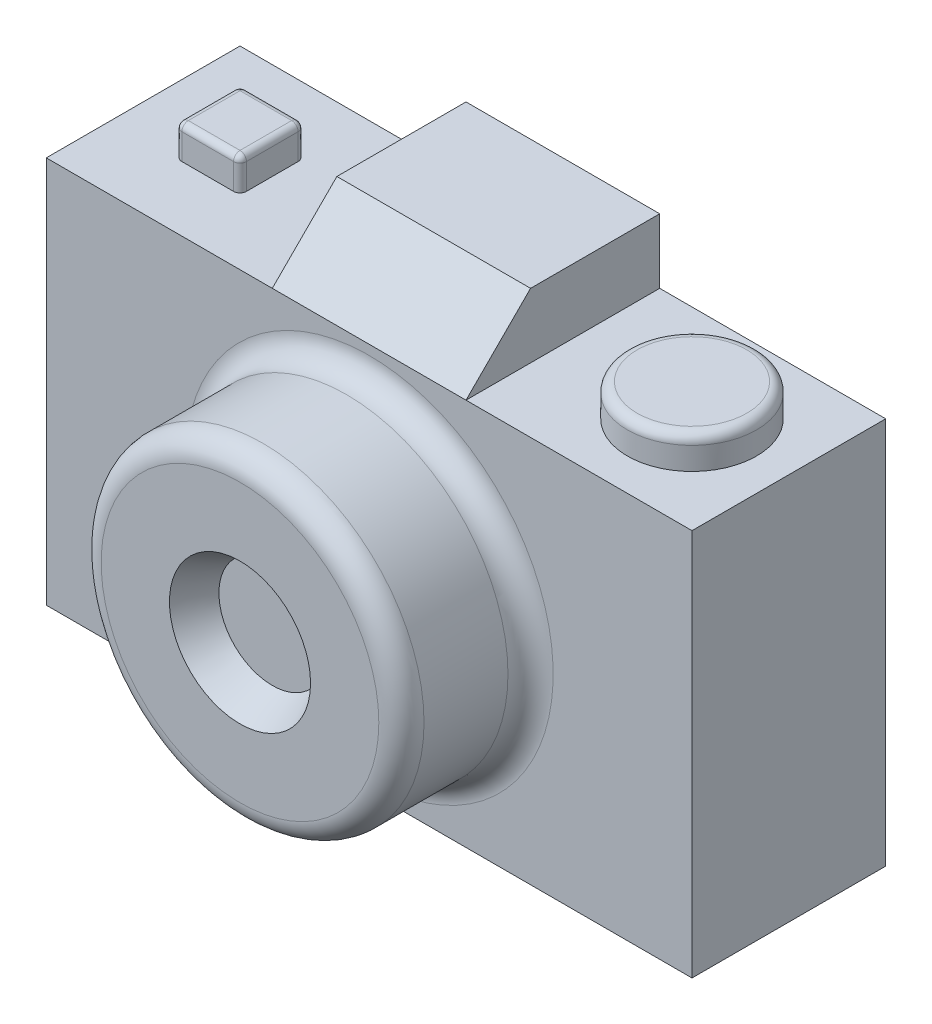
ISO-10303-21;
HEADER;
FILE_DESCRIPTION(('STEP AP214'),'2;1');
FILE_NAME('part.step','',(''),(''),'','','');
FILE_SCHEMA(('AUTOMOTIVE_DESIGN { 1 0 10303 214 1 1 1 1 }'));
ENDSEC;
DATA;
#1=APPLICATION_CONTEXT('core data for automotive mechanical design processes');
#2=APPLICATION_PROTOCOL_DEFINITION('international standard','automotive_design',2000,#1);
#3=PRODUCT_CONTEXT('',#1,'mechanical');
#4=PRODUCT('Part','Part','',(#3));
#5=PRODUCT_RELATED_PRODUCT_CATEGORY('part','',(#4));
#6=PRODUCT_DEFINITION_FORMATION('','',#4);
#7=PRODUCT_DEFINITION_CONTEXT('part definition',#1,'design');
#8=PRODUCT_DEFINITION('design','',#6,#7);
#9=PRODUCT_DEFINITION_SHAPE('','',#8);
#10=(LENGTH_UNIT() NAMED_UNIT(*) SI_UNIT(.MILLI.,.METRE.));
#11=(NAMED_UNIT(*) PLANE_ANGLE_UNIT() SI_UNIT($,.RADIAN.));
#12=(NAMED_UNIT(*) SI_UNIT($,.STERADIAN.) SOLID_ANGLE_UNIT());
#13=UNCERTAINTY_MEASURE_WITH_UNIT(LENGTH_MEASURE(1.E-05),#10,'distance_accuracy_value','');
#14=(GEOMETRIC_REPRESENTATION_CONTEXT(3) GLOBAL_UNCERTAINTY_ASSIGNED_CONTEXT((#13)) GLOBAL_UNIT_ASSIGNED_CONTEXT((#10,
#11,#12)) REPRESENTATION_CONTEXT('',''));
#15=CARTESIAN_POINT('',(0.,0.,0.));
#16=DIRECTION('',(0.,0.,1.));
#17=DIRECTION('',(1.,0.,0.));
#18=AXIS2_PLACEMENT_3D('',#15,#16,#17);
#19=CARTESIAN_POINT('',(0.,60.,0.));
#20=DIRECTION('',(0.,-1.,0.));
#21=DIRECTION('',(0.,0.,-1.));
#22=AXIS2_PLACEMENT_3D('',#19,#20,#21);
#23=PLANE('',#22);
#24=DIRECTION('',(0.,0.,-1.));
#25=VECTOR('',#24,1.);
#26=CARTESIAN_POINT('',(20.,60.,-20.));
#27=LINE('',#26,#25);
#28=CARTESIAN_POINT('',(20.,60.,-11.));
#29=VERTEX_POINT('',#28);
#30=CARTESIAN_POINT('',(20.,60.,-19.));
#31=VERTEX_POINT('',#30);
#32=EDGE_CURVE('E178',#29,#31,#27,.T.);
#33=ORIENTED_EDGE('',*,*,#32,.F.);
#34=CARTESIAN_POINT('',(19.,60.,-11.));
#35=DIRECTION('',(0.,-1.,0.));
#36=DIRECTION('',(0.,0.,-1.));
#37=AXIS2_PLACEMENT_3D('',#34,#35,#36);
#38=CIRCLE('',#37,1.);
#39=CARTESIAN_POINT('',(19.,60.,-10.));
#40=VERTEX_POINT('',#39);
#41=EDGE_CURVE('E282',#29,#40,#38,.T.);
#42=ORIENTED_EDGE('',*,*,#41,.T.);
#43=DIRECTION('',(1.,0.,0.));
#44=VECTOR('',#43,1.);
#45=CARTESIAN_POINT('',(10.,60.,-10.));
#46=LINE('',#45,#44);
#47=CARTESIAN_POINT('',(11.,60.,-10.));
#48=VERTEX_POINT('',#47);
#49=EDGE_CURVE('E200',#48,#40,#46,.T.);
#50=ORIENTED_EDGE('',*,*,#49,.F.);
#51=CARTESIAN_POINT('',(11.,60.,-11.));
#52=DIRECTION('',(0.,-1.,0.));
#53=DIRECTION('',(0.,0.,-1.));
#54=AXIS2_PLACEMENT_3D('',#51,#52,#53);
#55=CIRCLE('',#54,1.);
#56=CARTESIAN_POINT('',(10.,60.,-11.));
#57=VERTEX_POINT('',#56);
#58=EDGE_CURVE('E284',#48,#57,#55,.T.);
#59=ORIENTED_EDGE('',*,*,#58,.T.);
#60=DIRECTION('',(0.,0.,1.));
#61=VECTOR('',#60,1.);
#62=CARTESIAN_POINT('',(10.,60.,-20.));
#63=LINE('',#62,#61);
#64=CARTESIAN_POINT('',(10.,60.,-19.));
#65=VERTEX_POINT('',#64);
#66=EDGE_CURVE('E197',#65,#57,#63,.T.);
#67=ORIENTED_EDGE('',*,*,#66,.F.);
#68=CARTESIAN_POINT('',(11.,60.,-19.));
#69=DIRECTION('',(0.,-1.,0.));
#70=DIRECTION('',(0.,0.,-1.));
#71=AXIS2_PLACEMENT_3D('',#68,#69,#70);
#72=CIRCLE('',#71,1.);
#73=CARTESIAN_POINT('',(11.,60.,-20.));
#74=VERTEX_POINT('',#73);
#75=EDGE_CURVE('E278',#65,#74,#72,.T.);
#76=ORIENTED_EDGE('',*,*,#75,.T.);
#77=DIRECTION('',(-1.,0.,0.));
#78=VECTOR('',#77,1.);
#79=CARTESIAN_POINT('',(10.,60.,-20.));
#80=LINE('',#79,#78);
#81=CARTESIAN_POINT('',(19.,60.,-20.));
#82=VERTEX_POINT('',#81);
#83=EDGE_CURVE('E194',#82,#74,#80,.T.);
#84=ORIENTED_EDGE('',*,*,#83,.F.);
#85=CARTESIAN_POINT('',(19.,60.,-19.));
#86=DIRECTION('',(0.,-1.,0.));
#87=DIRECTION('',(0.,0.,-1.));
#88=AXIS2_PLACEMENT_3D('',#85,#86,#87);
#89=CIRCLE('',#88,1.);
#90=EDGE_CURVE('E280',#82,#31,#89,.T.);
#91=ORIENTED_EDGE('',*,*,#90,.T.);
#92=EDGE_LOOP('',(#33,#42,#50,#59,#67,#76,#84,#91));
#93=FACE_BOUND('',#92,.T.);
#94=DIRECTION('',(0.,0.,1.));
#95=VECTOR('',#94,1.);
#96=CARTESIAN_POINT('',(35.,60.,-30.));
#97=LINE('',#96,#95);
#98=CARTESIAN_POINT('',(35.,60.,-30.));
#99=VERTEX_POINT('',#98);
#100=CARTESIAN_POINT('',(35.,60.,0.));
#101=VERTEX_POINT('',#100);
#102=EDGE_CURVE('E188',#99,#101,#97,.T.);
#103=ORIENTED_EDGE('',*,*,#102,.F.);
#104=DIRECTION('',(-1.,0.,0.));
#105=VECTOR('',#104,1.);
#106=CARTESIAN_POINT('',(0.,60.,-30.));
#107=LINE('',#106,#105);
#108=CARTESIAN_POINT('',(0.,60.,-30.));
#109=VERTEX_POINT('',#108);
#110=EDGE_CURVE('E214',#99,#109,#107,.T.);
#111=ORIENTED_EDGE('',*,*,#110,.T.);
#112=DIRECTION('',(0.,0.,1.));
#113=VECTOR('',#112,1.);
#114=CARTESIAN_POINT('',(0.,60.,0.));
#115=LINE('',#114,#113);
#116=CARTESIAN_POINT('',(0.,60.,0.));
#117=VERTEX_POINT('',#116);
#118=EDGE_CURVE('E204',#109,#117,#115,.T.);
#119=ORIENTED_EDGE('',*,*,#118,.T.);
#120=DIRECTION('',(1.,0.,0.));
#121=VECTOR('',#120,1.);
#122=CARTESIAN_POINT('',(0.,60.,0.));
#123=LINE('',#122,#121);
#124=EDGE_CURVE('E209',#117,#101,#123,.T.);
#125=ORIENTED_EDGE('',*,*,#124,.T.);
#126=EDGE_LOOP('',(#103,#111,#119,#125));
#127=FACE_BOUND('',#126,.T.);
#128=ADVANCED_FACE('F33',(#93,#127),#23,.F.);
#129=CARTESIAN_POINT('',(85.,60.,-15.));
#130=DIRECTION('',(0.,-1.,0.));
#131=DIRECTION('',(0.,0.,-1.));
#132=AXIS2_PLACEMENT_3D('',#129,#130,#131);
#133=CIRCLE('',#132,9.99999999999999);
#134=CARTESIAN_POINT('',(85.,60.,-25.));
#135=VERTEX_POINT('',#134);
#136=EDGE_CURVE('E236',#135,#135,#133,.F.);
#137=ORIENTED_EDGE('',*,*,#136,.F.);
#138=EDGE_LOOP('',(#137));
#139=FACE_BOUND('',#138,.T.);
#140=DIRECTION('',(0.,0.,-1.));
#141=VECTOR('',#140,1.);
#142=CARTESIAN_POINT('',(65.,60.,-30.));
#143=LINE('',#142,#141);
#144=CARTESIAN_POINT('',(65.,60.,0.));
#145=VERTEX_POINT('',#144);
#146=CARTESIAN_POINT('',(65.,60.,-30.));
#147=VERTEX_POINT('',#146);
#148=EDGE_CURVE('E175',#145,#147,#143,.T.);
#149=ORIENTED_EDGE('',*,*,#148,.F.);
#150=CARTESIAN_POINT('',(100.,60.,0.));
#151=VERTEX_POINT('',#150);
#152=EDGE_CURVE('E207',#145,#151,#123,.T.);
#153=ORIENTED_EDGE('',*,*,#152,.T.);
#154=DIRECTION('',(0.,0.,-1.));
#155=VECTOR('',#154,1.);
#156=CARTESIAN_POINT('',(100.,60.,0.));
#157=LINE('',#156,#155);
#158=CARTESIAN_POINT('',(100.,60.,-30.));
#159=VERTEX_POINT('',#158);
#160=EDGE_CURVE('E212',#151,#159,#157,.T.);
#161=ORIENTED_EDGE('',*,*,#160,.T.);
#162=EDGE_CURVE('E215',#159,#147,#107,.T.);
#163=ORIENTED_EDGE('',*,*,#162,.T.);
#164=EDGE_LOOP('',(#149,#153,#161,#163));
#165=FACE_BOUND('',#164,.T.);
#166=ADVANCED_FACE('F368',(#139,#165),#23,.F.);
#167=CARTESIAN_POINT('',(0.,60.,0.));
#168=DIRECTION('',(1.,0.,0.));
#169=DIRECTION('',(0.,0.,-1.));
#170=AXIS2_PLACEMENT_3D('',#167,#168,#169);
#171=PLANE('',#170);
#172=DIRECTION('',(0.,0.,1.));
#173=VECTOR('',#172,1.);
#174=CARTESIAN_POINT('',(0.,0.,0.));
#175=LINE('',#174,#173);
#176=CARTESIAN_POINT('',(0.,0.,-30.));
#177=VERTEX_POINT('',#176);
#178=CARTESIAN_POINT('',(0.,0.,0.));
#179=VERTEX_POINT('',#178);
#180=EDGE_CURVE('E203',#177,#179,#175,.T.);
#181=ORIENTED_EDGE('',*,*,#180,.T.);
#182=DIRECTION('',(0.,-1.,0.));
#183=VECTOR('',#182,1.);
#184=CARTESIAN_POINT('',(0.,60.,0.));
#185=LINE('',#184,#183);
#186=EDGE_CURVE('E233',#117,#179,#185,.T.);
#187=ORIENTED_EDGE('',*,*,#186,.F.);
#188=ORIENTED_EDGE('',*,*,#118,.F.);
#189=DIRECTION('',(0.,-1.,0.));
#190=VECTOR('',#189,1.);
#191=CARTESIAN_POINT('',(0.,60.,-30.));
#192=LINE('',#191,#190);
#193=EDGE_CURVE('E217',#109,#177,#192,.T.);
#194=ORIENTED_EDGE('',*,*,#193,.T.);
#195=EDGE_LOOP('',(#181,#187,#188,#194));
#196=FACE_BOUND('',#195,.T.);
#197=ADVANCED_FACE('F374',(#196),#171,.F.);
#198=CARTESIAN_POINT('',(0.,60.,0.));
#199=DIRECTION('',(0.,0.,-1.));
#200=DIRECTION('',(-1.,0.,0.));
#201=AXIS2_PLACEMENT_3D('',#198,#199,#200);
#202=PLANE('',#201);
#203=CARTESIAN_POINT('',(50.,30.,0.));
#204=DIRECTION('',(0.,0.,-1.));
#205=DIRECTION('',(-1.,0.,0.));
#206=AXIS2_PLACEMENT_3D('',#203,#204,#205);
#207=CIRCLE('',#206,28.5);
#208=CARTESIAN_POINT('',(21.5,30.,0.));
#209=VERTEX_POINT('',#208);
#210=EDGE_CURVE('E41',#209,#209,#207,.T.);
#211=ORIENTED_EDGE('',*,*,#210,.T.);
#212=EDGE_LOOP('',(#211));
#213=FACE_BOUND('',#212,.T.);
#214=ORIENTED_EDGE('',*,*,#152,.F.);
#215=DIRECTION('',(-1.,0.,0.));
#216=VECTOR('',#215,1.);
#217=CARTESIAN_POINT('',(35.,60.,0.));
#218=LINE('',#217,#216);
#219=EDGE_CURVE('E242',#145,#101,#218,.T.);
#220=ORIENTED_EDGE('',*,*,#219,.T.);
#221=ORIENTED_EDGE('',*,*,#124,.F.);
#222=ORIENTED_EDGE('',*,*,#186,.T.);
#223=DIRECTION('',(1.,0.,0.));
#224=VECTOR('',#223,1.);
#225=CARTESIAN_POINT('',(0.,0.,0.));
#226=LINE('',#225,#224);
#227=CARTESIAN_POINT('',(100.,0.,0.));
#228=VERTEX_POINT('',#227);
#229=EDGE_CURVE('E220',#179,#228,#226,.T.);
#230=ORIENTED_EDGE('',*,*,#229,.T.);
#231=DIRECTION('',(0.,-1.,0.));
#232=VECTOR('',#231,1.);
#233=CARTESIAN_POINT('',(100.,60.,0.));
#234=LINE('',#233,#232);
#235=EDGE_CURVE('E230',#151,#228,#234,.T.);
#236=ORIENTED_EDGE('',*,*,#235,.F.);
#237=EDGE_LOOP('',(#214,#220,#221,#222,#230,#236));
#238=FACE_BOUND('',#237,.T.);
#239=ADVANCED_FACE('F334',(#213,#238),#202,.F.);
#240=CARTESIAN_POINT('',(100.,60.,0.));
#241=DIRECTION('',(-1.,0.,0.));
#242=DIRECTION('',(0.,0.,1.));
#243=AXIS2_PLACEMENT_3D('',#240,#241,#242);
#244=PLANE('',#243);
#245=DIRECTION('',(0.,0.,-1.));
#246=VECTOR('',#245,1.);
#247=CARTESIAN_POINT('',(100.,0.,0.));
#248=LINE('',#247,#246);
#249=CARTESIAN_POINT('',(100.,0.,-30.));
#250=VERTEX_POINT('',#249);
#251=EDGE_CURVE('E222',#228,#250,#248,.T.);
#252=ORIENTED_EDGE('',*,*,#251,.T.);
#253=DIRECTION('',(0.,-1.,0.));
#254=VECTOR('',#253,1.);
#255=CARTESIAN_POINT('',(100.,60.,-30.));
#256=LINE('',#255,#254);
#257=EDGE_CURVE('E227',#159,#250,#256,.T.);
#258=ORIENTED_EDGE('',*,*,#257,.F.);
#259=ORIENTED_EDGE('',*,*,#160,.F.);
#260=ORIENTED_EDGE('',*,*,#235,.T.);
#261=EDGE_LOOP('',(#252,#258,#259,#260));
#262=FACE_BOUND('',#261,.T.);
#263=ADVANCED_FACE('F384',(#262),#244,.F.);
#264=CARTESIAN_POINT('',(0.,60.,-30.));
#265=DIRECTION('',(0.,0.,1.));
#266=DIRECTION('',(1.,0.,0.));
#267=AXIS2_PLACEMENT_3D('',#264,#265,#266);
#268=PLANE('',#267);
#269=DIRECTION('',(-1.,0.,0.));
#270=VECTOR('',#269,1.);
#271=CARTESIAN_POINT('',(0.,0.,-30.));
#272=LINE('',#271,#270);
#273=EDGE_CURVE('E208',#250,#177,#272,.T.);
#274=ORIENTED_EDGE('',*,*,#273,.T.);
#275=ORIENTED_EDGE('',*,*,#193,.F.);
#276=ORIENTED_EDGE('',*,*,#110,.F.);
#277=DIRECTION('',(0.,-1.,0.));
#278=VECTOR('',#277,1.);
#279=CARTESIAN_POINT('',(35.,70.,-30.));
#280=LINE('',#279,#278);
#281=CARTESIAN_POINT('',(35.,70.,-30.));
#282=VERTEX_POINT('',#281);
#283=EDGE_CURVE('E179',#282,#99,#280,.T.);
#284=ORIENTED_EDGE('',*,*,#283,.F.);
#285=DIRECTION('',(-1.,0.,0.));
#286=VECTOR('',#285,1.);
#287=CARTESIAN_POINT('',(35.,70.,-30.));
#288=LINE('',#287,#286);
#289=CARTESIAN_POINT('',(65.,70.,-30.));
#290=VERTEX_POINT('',#289);
#291=EDGE_CURVE('E163',#290,#282,#288,.T.);
#292=ORIENTED_EDGE('',*,*,#291,.F.);
#293=DIRECTION('',(0.,-1.,0.));
#294=VECTOR('',#293,1.);
#295=CARTESIAN_POINT('',(65.,70.,-30.));
#296=LINE('',#295,#294);
#297=EDGE_CURVE('E172',#290,#147,#296,.T.);
#298=ORIENTED_EDGE('',*,*,#297,.T.);
#299=ORIENTED_EDGE('',*,*,#162,.F.);
#300=ORIENTED_EDGE('',*,*,#257,.T.);
#301=EDGE_LOOP('',(#274,#275,#276,#284,#292,#298,#299,#300));
#302=FACE_BOUND('',#301,.T.);
#303=ADVANCED_FACE('F181',(#302),#268,.F.);
#304=CARTESIAN_POINT('',(0.,0.,0.));
#305=DIRECTION('',(0.,-1.,0.));
#306=DIRECTION('',(0.,0.,-1.));
#307=AXIS2_PLACEMENT_3D('',#304,#305,#306);
#308=PLANE('',#307);
#309=ORIENTED_EDGE('',*,*,#180,.F.);
#310=ORIENTED_EDGE('',*,*,#273,.F.);
#311=ORIENTED_EDGE('',*,*,#251,.F.);
#312=ORIENTED_EDGE('',*,*,#229,.F.);
#313=EDGE_LOOP('',(#309,#310,#311,#312));
#314=FACE_BOUND('',#313,.T.);
#315=ADVANCED_FACE('F347',(#314),#308,.T.);
#316=CARTESIAN_POINT('',(50.,30.,20.));
#317=DIRECTION('',(0.,0.,-1.));
#318=DIRECTION('',(-1.,0.,0.));
#319=AXIS2_PLACEMENT_3D('',#316,#317,#318);
#320=CYLINDRICAL_SURFACE('',#319,25.);
#321=CARTESIAN_POINT('',(50.,30.,3.5));
#322=DIRECTION('',(0.,0.,-1.));
#323=DIRECTION('',(-1.,0.,0.));
#324=AXIS2_PLACEMENT_3D('',#321,#322,#323);
#325=CIRCLE('',#324,25.);
#326=CARTESIAN_POINT('',(25.,30.,3.5));
#327=VERTEX_POINT('',#326);
#328=EDGE_CURVE('E329',#327,#327,#325,.F.);
#329=ORIENTED_EDGE('',*,*,#328,.T.);
#330=EDGE_LOOP('',(#329));
#331=FACE_BOUND('',#330,.T.);
#332=CARTESIAN_POINT('',(50.,30.,16.5));
#333=DIRECTION('',(0.,0.,1.));
#334=DIRECTION('',(1.,0.,0.));
#335=AXIS2_PLACEMENT_3D('',#332,#333,#334);
#336=CIRCLE('',#335,25.);
#337=CARTESIAN_POINT('',(75.,30.,16.5));
#338=VERTEX_POINT('',#337);
#339=EDGE_CURVE('E326',#338,#338,#336,.F.);
#340=ORIENTED_EDGE('',*,*,#339,.T.);
#341=EDGE_LOOP('',(#340));
#342=FACE_BOUND('',#341,.T.);
#343=ADVANCED_FACE('F343',(#331,#342),#320,.T.);
#344=CARTESIAN_POINT('',(50.,30.,20.));
#345=DIRECTION('',(0.,0.,1.));
#346=DIRECTION('',(1.,0.,0.));
#347=AXIS2_PLACEMENT_3D('',#344,#345,#346);
#348=PLANE('',#347);
#349=CARTESIAN_POINT('',(50.,30.,20.));
#350=DIRECTION('',(0.,0.,1.));
#351=DIRECTION('',(1.,0.,0.));
#352=AXIS2_PLACEMENT_3D('',#349,#350,#351);
#353=CIRCLE('',#352,10.9251280428387);
#354=CARTESIAN_POINT('',(60.9251280428387,30.,20.));
#355=VERTEX_POINT('',#354);
#356=EDGE_CURVE('E495',#355,#355,#353,.T.);
#357=ORIENTED_EDGE('',*,*,#356,.F.);
#358=EDGE_LOOP('',(#357));
#359=FACE_BOUND('',#358,.T.);
#360=CARTESIAN_POINT('',(50.,30.,20.));
#361=DIRECTION('',(0.,0.,1.));
#362=DIRECTION('',(1.,0.,0.));
#363=AXIS2_PLACEMENT_3D('',#360,#361,#362);
#364=CIRCLE('',#363,21.5);
#365=CARTESIAN_POINT('',(71.5,30.,20.));
#366=VERTEX_POINT('',#365);
#367=EDGE_CURVE('E11',#366,#366,#364,.T.);
#368=ORIENTED_EDGE('',*,*,#367,.T.);
#369=EDGE_LOOP('',(#368));
#370=FACE_BOUND('',#369,.T.);
#371=ADVANCED_FACE('F346',(#359,#370),#348,.T.);
#372=CARTESIAN_POINT('',(85.,65.,-15.));
#373=DIRECTION('',(0.,-1.,0.));
#374=DIRECTION('',(0.,0.,-1.));
#375=AXIS2_PLACEMENT_3D('',#372,#373,#374);
#376=CYLINDRICAL_SURFACE('',#375,9.99999999999999);
#377=CARTESIAN_POINT('',(85.,63.5,-15.));
#378=DIRECTION('',(0.,1.,0.));
#379=DIRECTION('',(0.,0.,1.));
#380=AXIS2_PLACEMENT_3D('',#377,#378,#379);
#381=CIRCLE('',#380,9.99999999999999);
#382=CARTESIAN_POINT('',(85.,63.5,-5.00000000000001));
#383=VERTEX_POINT('',#382);
#384=EDGE_CURVE('E323',#383,#383,#381,.F.);
#385=ORIENTED_EDGE('',*,*,#384,.T.);
#386=EDGE_LOOP('',(#385));
#387=FACE_BOUND('',#386,.T.);
#388=ORIENTED_EDGE('',*,*,#136,.T.);
#389=EDGE_LOOP('',(#388));
#390=FACE_BOUND('',#389,.T.);
#391=ADVANCED_FACE('F357',(#387,#390),#376,.T.);
#392=CARTESIAN_POINT('',(85.,65.,-15.));
#393=DIRECTION('',(0.,1.,0.));
#394=DIRECTION('',(0.,0.,1.));
#395=AXIS2_PLACEMENT_3D('',#392,#393,#394);
#396=PLANE('',#395);
#397=CARTESIAN_POINT('',(85.,65.,-15.));
#398=DIRECTION('',(0.,1.,0.));
#399=DIRECTION('',(0.,0.,1.));
#400=AXIS2_PLACEMENT_3D('',#397,#398,#399);
#401=CIRCLE('',#400,8.49999999999999);
#402=CARTESIAN_POINT('',(85.,65.,-6.50000000000001));
#403=VERTEX_POINT('',#402);
#404=EDGE_CURVE('E286',#403,#403,#401,.T.);
#405=ORIENTED_EDGE('',*,*,#404,.T.);
#406=EDGE_LOOP('',(#405));
#407=FACE_BOUND('',#406,.T.);
#408=ADVANCED_FACE('F363',(#407),#396,.T.);
#409=CARTESIAN_POINT('',(20.,65.,-20.));
#410=DIRECTION('',(-1.,0.,0.));
#411=DIRECTION('',(0.,0.,1.));
#412=AXIS2_PLACEMENT_3D('',#409,#410,#411);
#413=PLANE('',#412);
#414=ORIENTED_EDGE('',*,*,#32,.T.);
#415=DIRECTION('',(0.,-1.,0.));
#416=VECTOR('',#415,1.);
#417=CARTESIAN_POINT('',(20.,65.,-19.));
#418=LINE('',#417,#416);
#419=CARTESIAN_POINT('',(20.,64.,-19.));
#420=VERTEX_POINT('',#419);
#421=EDGE_CURVE('E48',#31,#420,#418,.F.);
#422=ORIENTED_EDGE('',*,*,#421,.T.);
#423=DIRECTION('',(0.,0.,-1.));
#424=VECTOR('',#423,1.);
#425=CARTESIAN_POINT('',(20.,64.,-10.));
#426=LINE('',#425,#424);
#427=CARTESIAN_POINT('',(20.,64.,-11.));
#428=VERTEX_POINT('',#427);
#429=EDGE_CURVE('E53',#420,#428,#426,.F.);
#430=ORIENTED_EDGE('',*,*,#429,.T.);
#431=DIRECTION('',(0.,-1.,0.));
#432=VECTOR('',#431,1.);
#433=CARTESIAN_POINT('',(20.,65.,-11.));
#434=LINE('',#433,#432);
#435=EDGE_CURVE('E274',#428,#29,#434,.T.);
#436=ORIENTED_EDGE('',*,*,#435,.T.);
#437=EDGE_LOOP('',(#414,#422,#430,#436));
#438=FACE_BOUND('',#437,.T.);
#439=ADVANCED_FACE('F454',(#438),#413,.F.);
#440=CARTESIAN_POINT('',(10.,65.,-20.));
#441=DIRECTION('',(0.,0.,1.));
#442=DIRECTION('',(1.,0.,0.));
#443=AXIS2_PLACEMENT_3D('',#440,#441,#442);
#444=PLANE('',#443);
#445=ORIENTED_EDGE('',*,*,#83,.T.);
#446=DIRECTION('',(0.,-1.,0.));
#447=VECTOR('',#446,1.);
#448=CARTESIAN_POINT('',(11.,65.,-20.));
#449=LINE('',#448,#447);
#450=CARTESIAN_POINT('',(11.,64.,-20.));
#451=VERTEX_POINT('',#450);
#452=EDGE_CURVE('E272',#74,#451,#449,.F.);
#453=ORIENTED_EDGE('',*,*,#452,.T.);
#454=DIRECTION('',(-1.,0.,0.));
#455=VECTOR('',#454,1.);
#456=CARTESIAN_POINT('',(20.,64.,-20.));
#457=LINE('',#456,#455);
#458=CARTESIAN_POINT('',(19.,64.,-20.));
#459=VERTEX_POINT('',#458);
#460=EDGE_CURVE('E270',#451,#459,#457,.F.);
#461=ORIENTED_EDGE('',*,*,#460,.T.);
#462=DIRECTION('',(0.,-1.,0.));
#463=VECTOR('',#462,1.);
#464=CARTESIAN_POINT('',(19.,65.,-20.));
#465=LINE('',#464,#463);
#466=EDGE_CURVE('E268',#459,#82,#465,.T.);
#467=ORIENTED_EDGE('',*,*,#466,.T.);
#468=EDGE_LOOP('',(#445,#453,#461,#467));
#469=FACE_BOUND('',#468,.T.);
#470=ADVANCED_FACE('F459',(#469),#444,.F.);
#471=CARTESIAN_POINT('',(10.,65.,-20.));
#472=DIRECTION('',(1.,0.,0.));
#473=DIRECTION('',(0.,0.,-1.));
#474=AXIS2_PLACEMENT_3D('',#471,#472,#473);
#475=PLANE('',#474);
#476=DIRECTION('',(0.,0.,1.));
#477=VECTOR('',#476,1.);
#478=CARTESIAN_POINT('',(10.,64.,-20.));
#479=LINE('',#478,#477);
#480=CARTESIAN_POINT('',(10.,64.,-11.));
#481=VERTEX_POINT('',#480);
#482=CARTESIAN_POINT('',(10.,64.,-19.));
#483=VERTEX_POINT('',#482);
#484=EDGE_CURVE('E264',#481,#483,#479,.F.);
#485=ORIENTED_EDGE('',*,*,#484,.T.);
#486=DIRECTION('',(0.,-1.,0.));
#487=VECTOR('',#486,1.);
#488=CARTESIAN_POINT('',(10.,65.,-19.));
#489=LINE('',#488,#487);
#490=EDGE_CURVE('E266',#483,#65,#489,.T.);
#491=ORIENTED_EDGE('',*,*,#490,.T.);
#492=ORIENTED_EDGE('',*,*,#66,.T.);
#493=DIRECTION('',(0.,-1.,0.));
#494=VECTOR('',#493,1.);
#495=CARTESIAN_POINT('',(10.,65.,-11.));
#496=LINE('',#495,#494);
#497=EDGE_CURVE('E262',#57,#481,#496,.F.);
#498=ORIENTED_EDGE('',*,*,#497,.T.);
#499=EDGE_LOOP('',(#485,#491,#492,#498));
#500=FACE_BOUND('',#499,.T.);
#501=ADVANCED_FACE('F464',(#500),#475,.F.);
#502=CARTESIAN_POINT('',(10.,65.,-10.));
#503=DIRECTION('',(0.,0.,-1.));
#504=DIRECTION('',(-1.,0.,0.));
#505=AXIS2_PLACEMENT_3D('',#502,#503,#504);
#506=PLANE('',#505);
#507=ORIENTED_EDGE('',*,*,#49,.T.);
#508=DIRECTION('',(0.,-1.,0.));
#509=VECTOR('',#508,1.);
#510=CARTESIAN_POINT('',(19.,65.,-10.));
#511=LINE('',#510,#509);
#512=CARTESIAN_POINT('',(19.,64.,-10.));
#513=VERTEX_POINT('',#512);
#514=EDGE_CURVE('E260',#40,#513,#511,.F.);
#515=ORIENTED_EDGE('',*,*,#514,.T.);
#516=DIRECTION('',(1.,0.,0.));
#517=VECTOR('',#516,1.);
#518=CARTESIAN_POINT('',(10.,64.,-10.));
#519=LINE('',#518,#517);
#520=CARTESIAN_POINT('',(11.,64.,-10.));
#521=VERTEX_POINT('',#520);
#522=EDGE_CURVE('E257',#513,#521,#519,.F.);
#523=ORIENTED_EDGE('',*,*,#522,.T.);
#524=DIRECTION('',(0.,-1.,0.));
#525=VECTOR('',#524,1.);
#526=CARTESIAN_POINT('',(11.,65.,-10.));
#527=LINE('',#526,#525);
#528=EDGE_CURVE('E255',#521,#48,#527,.T.);
#529=ORIENTED_EDGE('',*,*,#528,.T.);
#530=EDGE_LOOP('',(#507,#515,#523,#529));
#531=FACE_BOUND('',#530,.T.);
#532=ADVANCED_FACE('F468',(#531),#506,.F.);
#533=CARTESIAN_POINT('',(0.,65.,0.));
#534=DIRECTION('',(0.,1.,0.));
#535=DIRECTION('',(0.,0.,1.));
#536=AXIS2_PLACEMENT_3D('',#533,#534,#535);
#537=PLANE('',#536);
#538=DIRECTION('',(0.,0.,1.));
#539=VECTOR('',#538,1.);
#540=CARTESIAN_POINT('',(11.,65.,-10.));
#541=LINE('',#540,#539);
#542=CARTESIAN_POINT('',(11.,65.,-19.));
#543=VERTEX_POINT('',#542);
#544=CARTESIAN_POINT('',(11.,65.,-11.));
#545=VERTEX_POINT('',#544);
#546=EDGE_CURVE('E250',#543,#545,#541,.T.);
#547=ORIENTED_EDGE('',*,*,#546,.T.);
#548=DIRECTION('',(1.,0.,0.));
#549=VECTOR('',#548,1.);
#550=CARTESIAN_POINT('',(20.,65.,-11.));
#551=LINE('',#550,#549);
#552=CARTESIAN_POINT('',(19.,65.,-11.));
#553=VERTEX_POINT('',#552);
#554=EDGE_CURVE('E252',#545,#553,#551,.T.);
#555=ORIENTED_EDGE('',*,*,#554,.T.);
#556=DIRECTION('',(0.,0.,-1.));
#557=VECTOR('',#556,1.);
#558=CARTESIAN_POINT('',(19.,65.,-20.));
#559=LINE('',#558,#557);
#560=CARTESIAN_POINT('',(19.,65.,-19.));
#561=VERTEX_POINT('',#560);
#562=EDGE_CURVE('E246',#553,#561,#559,.T.);
#563=ORIENTED_EDGE('',*,*,#562,.T.);
#564=DIRECTION('',(-1.,0.,0.));
#565=VECTOR('',#564,1.);
#566=CARTESIAN_POINT('',(10.,65.,-19.));
#567=LINE('',#566,#565);
#568=EDGE_CURVE('E248',#561,#543,#567,.T.);
#569=ORIENTED_EDGE('',*,*,#568,.T.);
#570=EDGE_LOOP('',(#547,#555,#563,#569));
#571=FACE_BOUND('',#570,.T.);
#572=ADVANCED_FACE('F472',(#571),#537,.T.);
#573=CARTESIAN_POINT('',(35.,70.,-30.));
#574=DIRECTION('',(1.,0.,0.));
#575=DIRECTION('',(0.,0.,-1.));
#576=AXIS2_PLACEMENT_3D('',#573,#574,#575);
#577=PLANE('',#576);
#578=ORIENTED_EDGE('',*,*,#102,.T.);
#579=DIRECTION('',(0.,0.707106781186549,-0.707106781186546));
#580=VECTOR('',#579,1.);
#581=CARTESIAN_POINT('',(35.,70.,-9.99999999999999));
#582=LINE('',#581,#580);
#583=CARTESIAN_POINT('',(35.,70.,-9.99999999999999));
#584=VERTEX_POINT('',#583);
#585=EDGE_CURVE('E244',#101,#584,#582,.T.);
#586=ORIENTED_EDGE('',*,*,#585,.T.);
#587=DIRECTION('',(0.,0.,1.));
#588=VECTOR('',#587,1.);
#589=CARTESIAN_POINT('',(35.,70.,-30.));
#590=LINE('',#589,#588);
#591=EDGE_CURVE('E168',#282,#584,#590,.T.);
#592=ORIENTED_EDGE('',*,*,#591,.F.);
#593=ORIENTED_EDGE('',*,*,#283,.T.);
#594=EDGE_LOOP('',(#578,#586,#592,#593));
#595=FACE_BOUND('',#594,.T.);
#596=ADVANCED_FACE('F476',(#595),#577,.F.);
#597=CARTESIAN_POINT('',(65.,70.,-30.));
#598=DIRECTION('',(-1.,0.,0.));
#599=DIRECTION('',(0.,0.,1.));
#600=AXIS2_PLACEMENT_3D('',#597,#598,#599);
#601=PLANE('',#600);
#602=DIRECTION('',(0.,0.,-1.));
#603=VECTOR('',#602,1.);
#604=CARTESIAN_POINT('',(65.,70.,-30.));
#605=LINE('',#604,#603);
#606=CARTESIAN_POINT('',(65.,70.,-9.99999999999999));
#607=VERTEX_POINT('',#606);
#608=EDGE_CURVE('E158',#607,#290,#605,.T.);
#609=ORIENTED_EDGE('',*,*,#608,.F.);
#610=DIRECTION('',(0.,-0.707106781186549,0.707106781186546));
#611=VECTOR('',#610,1.);
#612=CARTESIAN_POINT('',(65.,70.,-9.99999999999999));
#613=LINE('',#612,#611);
#614=EDGE_CURVE('E240',#607,#145,#613,.T.);
#615=ORIENTED_EDGE('',*,*,#614,.T.);
#616=ORIENTED_EDGE('',*,*,#148,.T.);
#617=ORIENTED_EDGE('',*,*,#297,.F.);
#618=EDGE_LOOP('',(#609,#615,#616,#617));
#619=FACE_BOUND('',#618,.T.);
#620=ADVANCED_FACE('F173',(#619),#601,.F.);
#621=CARTESIAN_POINT('',(0.,70.,0.));
#622=DIRECTION('',(0.,1.,0.));
#623=DIRECTION('',(0.,0.,1.));
#624=AXIS2_PLACEMENT_3D('',#621,#622,#623);
#625=PLANE('',#624);
#626=ORIENTED_EDGE('',*,*,#591,.T.);
#627=DIRECTION('',(1.,0.,0.));
#628=VECTOR('',#627,1.);
#629=CARTESIAN_POINT('',(65.,70.,-9.99999999999999));
#630=LINE('',#629,#628);
#631=EDGE_CURVE('E166',#584,#607,#630,.T.);
#632=ORIENTED_EDGE('',*,*,#631,.T.);
#633=ORIENTED_EDGE('',*,*,#608,.T.);
#634=ORIENTED_EDGE('',*,*,#291,.T.);
#635=EDGE_LOOP('',(#626,#632,#633,#634));
#636=FACE_BOUND('',#635,.T.);
#637=ADVANCED_FACE('F161',(#636),#625,.T.);
#638=CARTESIAN_POINT('',(0.,70.,-9.99999999999999));
#639=DIRECTION('',(0.,0.707106781186546,0.707106781186549));
#640=DIRECTION('',(-1.,0.,0.));
#641=AXIS2_PLACEMENT_3D('',#638,#639,#640);
#642=PLANE('',#641);
#643=ORIENTED_EDGE('',*,*,#585,.F.);
#644=ORIENTED_EDGE('',*,*,#219,.F.);
#645=ORIENTED_EDGE('',*,*,#614,.F.);
#646=ORIENTED_EDGE('',*,*,#631,.F.);
#647=EDGE_LOOP('',(#643,#644,#645,#646));
#648=FACE_BOUND('',#647,.T.);
#649=ADVANCED_FACE('F393',(#648),#642,.T.);
#650=CARTESIAN_POINT('',(11.,65.,-19.));
#651=DIRECTION('',(0.,-1.,0.));
#652=DIRECTION('',(0.,0.,-1.));
#653=AXIS2_PLACEMENT_3D('',#650,#651,#652);
#654=CYLINDRICAL_SURFACE('',#653,1.);
#655=ORIENTED_EDGE('',*,*,#75,.F.);
#656=ORIENTED_EDGE('',*,*,#490,.F.);
#657=CARTESIAN_POINT('',(11.,64.,-19.));
#658=DIRECTION('',(0.,1.,0.));
#659=DIRECTION('',(0.,0.,1.));
#660=AXIS2_PLACEMENT_3D('',#657,#658,#659);
#661=CIRCLE('',#660,1.);
#662=EDGE_CURVE('E191',#451,#483,#661,.T.);
#663=ORIENTED_EDGE('',*,*,#662,.F.);
#664=ORIENTED_EDGE('',*,*,#452,.F.);
#665=EDGE_LOOP('',(#655,#656,#663,#664));
#666=FACE_BOUND('',#665,.T.);
#667=ADVANCED_FACE('F396',(#666),#654,.T.);
#668=CARTESIAN_POINT('',(0.,64.,-19.));
#669=DIRECTION('',(1.,0.,0.));
#670=DIRECTION('',(0.,0.,-1.));
#671=AXIS2_PLACEMENT_3D('',#668,#669,#670);
#672=CYLINDRICAL_SURFACE('',#671,1.);
#673=CARTESIAN_POINT('',(19.,64.,-19.));
#674=DIRECTION('',(1.,0.,0.));
#675=DIRECTION('',(0.,0.,-1.));
#676=AXIS2_PLACEMENT_3D('',#673,#674,#675);
#677=CIRCLE('',#676,1.);
#678=EDGE_CURVE('E313',#459,#561,#677,.T.);
#679=ORIENTED_EDGE('',*,*,#678,.F.);
#680=ORIENTED_EDGE('',*,*,#460,.F.);
#681=CARTESIAN_POINT('',(11.,64.,-19.));
#682=DIRECTION('',(-1.,0.,0.));
#683=DIRECTION('',(0.,0.,1.));
#684=AXIS2_PLACEMENT_3D('',#681,#682,#683);
#685=CIRCLE('',#684,1.);
#686=EDGE_CURVE('E316',#543,#451,#685,.T.);
#687=ORIENTED_EDGE('',*,*,#686,.F.);
#688=ORIENTED_EDGE('',*,*,#568,.F.);
#689=EDGE_LOOP('',(#679,#680,#687,#688));
#690=FACE_BOUND('',#689,.T.);
#691=ADVANCED_FACE('F437',(#690),#672,.T.);
#692=CARTESIAN_POINT('',(19.,65.,-19.));
#693=DIRECTION('',(0.,-1.,0.));
#694=DIRECTION('',(0.,0.,-1.));
#695=AXIS2_PLACEMENT_3D('',#692,#693,#694);
#696=CYLINDRICAL_SURFACE('',#695,1.);
#697=ORIENTED_EDGE('',*,*,#90,.F.);
#698=ORIENTED_EDGE('',*,*,#466,.F.);
#699=CARTESIAN_POINT('',(19.,64.,-19.));
#700=DIRECTION('',(0.,1.,0.));
#701=DIRECTION('',(0.,0.,1.));
#702=AXIS2_PLACEMENT_3D('',#699,#700,#701);
#703=CIRCLE('',#702,1.);
#704=EDGE_CURVE('E310',#420,#459,#703,.T.);
#705=ORIENTED_EDGE('',*,*,#704,.F.);
#706=ORIENTED_EDGE('',*,*,#421,.F.);
#707=EDGE_LOOP('',(#697,#698,#705,#706));
#708=FACE_BOUND('',#707,.T.);
#709=ADVANCED_FACE('F433',(#708),#696,.T.);
#710=CARTESIAN_POINT('',(11.,64.,-19.));
#711=DIRECTION('',(0.,0.,1.));
#712=DIRECTION('',(1.,0.,0.));
#713=AXIS2_PLACEMENT_3D('',#710,#711,#712);
#714=SPHERICAL_SURFACE('',#713,1.);
#715=ORIENTED_EDGE('',*,*,#686,.T.);
#716=ORIENTED_EDGE('',*,*,#662,.T.);
#717=CARTESIAN_POINT('',(11.,64.,-19.));
#718=DIRECTION('',(0.,0.,-1.));
#719=DIRECTION('',(-1.,0.,0.));
#720=AXIS2_PLACEMENT_3D('',#717,#718,#719);
#721=CIRCLE('',#720,1.);
#722=EDGE_CURVE('E307',#543,#483,#721,.F.);
#723=ORIENTED_EDGE('',*,*,#722,.F.);
#724=EDGE_LOOP('',(#715,#716,#723));
#725=FACE_BOUND('',#724,.T.);
#726=ADVANCED_FACE('F429',(#725),#714,.T.);
#727=CARTESIAN_POINT('',(19.,64.,-19.));
#728=DIRECTION('',(0.,0.,1.));
#729=DIRECTION('',(1.,0.,0.));
#730=AXIS2_PLACEMENT_3D('',#727,#728,#729);
#731=SPHERICAL_SURFACE('',#730,1.);
#732=ORIENTED_EDGE('',*,*,#704,.T.);
#733=ORIENTED_EDGE('',*,*,#678,.T.);
#734=CARTESIAN_POINT('',(19.,64.,-19.));
#735=DIRECTION('',(0.,0.,-1.));
#736=DIRECTION('',(-1.,0.,0.));
#737=AXIS2_PLACEMENT_3D('',#734,#735,#736);
#738=CIRCLE('',#737,1.);
#739=EDGE_CURVE('E304',#420,#561,#738,.F.);
#740=ORIENTED_EDGE('',*,*,#739,.F.);
#741=EDGE_LOOP('',(#732,#733,#740));
#742=FACE_BOUND('',#741,.T.);
#743=ADVANCED_FACE('F425',(#742),#731,.T.);
#744=CARTESIAN_POINT('',(11.,65.,-11.));
#745=DIRECTION('',(0.,-1.,0.));
#746=DIRECTION('',(0.,0.,-1.));
#747=AXIS2_PLACEMENT_3D('',#744,#745,#746);
#748=CYLINDRICAL_SURFACE('',#747,1.);
#749=ORIENTED_EDGE('',*,*,#58,.F.);
#750=ORIENTED_EDGE('',*,*,#528,.F.);
#751=CARTESIAN_POINT('',(11.,64.,-11.));
#752=DIRECTION('',(0.,1.,0.));
#753=DIRECTION('',(0.,0.,1.));
#754=AXIS2_PLACEMENT_3D('',#751,#752,#753);
#755=CIRCLE('',#754,1.);
#756=EDGE_CURVE('E301',#481,#521,#755,.T.);
#757=ORIENTED_EDGE('',*,*,#756,.F.);
#758=ORIENTED_EDGE('',*,*,#497,.F.);
#759=EDGE_LOOP('',(#749,#750,#757,#758));
#760=FACE_BOUND('',#759,.T.);
#761=ADVANCED_FACE('F421',(#760),#748,.T.);
#762=CARTESIAN_POINT('',(11.,64.,0.));
#763=DIRECTION('',(0.,0.,-1.));
#764=DIRECTION('',(-1.,0.,0.));
#765=AXIS2_PLACEMENT_3D('',#762,#763,#764);
#766=CYLINDRICAL_SURFACE('',#765,1.);
#767=ORIENTED_EDGE('',*,*,#722,.T.);
#768=ORIENTED_EDGE('',*,*,#484,.F.);
#769=CARTESIAN_POINT('',(11.,64.,-11.));
#770=DIRECTION('',(0.,0.,1.));
#771=DIRECTION('',(1.,0.,0.));
#772=AXIS2_PLACEMENT_3D('',#769,#770,#771);
#773=CIRCLE('',#772,1.);
#774=EDGE_CURVE('E298',#545,#481,#773,.T.);
#775=ORIENTED_EDGE('',*,*,#774,.F.);
#776=ORIENTED_EDGE('',*,*,#546,.F.);
#777=EDGE_LOOP('',(#767,#768,#775,#776));
#778=FACE_BOUND('',#777,.T.);
#779=ADVANCED_FACE('F417',(#778),#766,.T.);
#780=CARTESIAN_POINT('',(19.,64.,0.));
#781=DIRECTION('',(0.,0.,1.));
#782=DIRECTION('',(1.,0.,0.));
#783=AXIS2_PLACEMENT_3D('',#780,#781,#782);
#784=CYLINDRICAL_SURFACE('',#783,1.);
#785=ORIENTED_EDGE('',*,*,#739,.T.);
#786=ORIENTED_EDGE('',*,*,#562,.F.);
#787=CARTESIAN_POINT('',(19.,64.,-11.));
#788=DIRECTION('',(0.,0.,1.));
#789=DIRECTION('',(1.,0.,0.));
#790=AXIS2_PLACEMENT_3D('',#787,#788,#789);
#791=CIRCLE('',#790,1.);
#792=EDGE_CURVE('E295',#428,#553,#791,.T.);
#793=ORIENTED_EDGE('',*,*,#792,.F.);
#794=ORIENTED_EDGE('',*,*,#429,.F.);
#795=EDGE_LOOP('',(#785,#786,#793,#794));
#796=FACE_BOUND('',#795,.T.);
#797=ADVANCED_FACE('F413',(#796),#784,.T.);
#798=CARTESIAN_POINT('',(19.,65.,-11.));
#799=DIRECTION('',(0.,-1.,0.));
#800=DIRECTION('',(0.,0.,-1.));
#801=AXIS2_PLACEMENT_3D('',#798,#799,#800);
#802=CYLINDRICAL_SURFACE('',#801,1.);
#803=ORIENTED_EDGE('',*,*,#41,.F.);
#804=ORIENTED_EDGE('',*,*,#435,.F.);
#805=CARTESIAN_POINT('',(19.,64.,-11.));
#806=DIRECTION('',(0.,1.,0.));
#807=DIRECTION('',(0.,0.,1.));
#808=AXIS2_PLACEMENT_3D('',#805,#806,#807);
#809=CIRCLE('',#808,1.);
#810=EDGE_CURVE('E292',#513,#428,#809,.T.);
#811=ORIENTED_EDGE('',*,*,#810,.F.);
#812=ORIENTED_EDGE('',*,*,#514,.F.);
#813=EDGE_LOOP('',(#803,#804,#811,#812));
#814=FACE_BOUND('',#813,.T.);
#815=ADVANCED_FACE('F409',(#814),#802,.T.);
#816=CARTESIAN_POINT('',(11.,64.,-11.));
#817=DIRECTION('',(0.,0.,1.));
#818=DIRECTION('',(1.,0.,0.));
#819=AXIS2_PLACEMENT_3D('',#816,#817,#818);
#820=SPHERICAL_SURFACE('',#819,1.);
#821=ORIENTED_EDGE('',*,*,#774,.T.);
#822=ORIENTED_EDGE('',*,*,#756,.T.);
#823=CARTESIAN_POINT('',(11.,64.,-11.));
#824=DIRECTION('',(-1.,0.,0.));
#825=DIRECTION('',(0.,0.,1.));
#826=AXIS2_PLACEMENT_3D('',#823,#824,#825);
#827=CIRCLE('',#826,1.);
#828=EDGE_CURVE('E289',#545,#521,#827,.F.);
#829=ORIENTED_EDGE('',*,*,#828,.F.);
#830=EDGE_LOOP('',(#821,#822,#829));
#831=FACE_BOUND('',#830,.T.);
#832=ADVANCED_FACE('F405',(#831),#820,.T.);
#833=CARTESIAN_POINT('',(19.,64.,-11.));
#834=DIRECTION('',(0.,0.,1.));
#835=DIRECTION('',(1.,0.,0.));
#836=AXIS2_PLACEMENT_3D('',#833,#834,#835);
#837=SPHERICAL_SURFACE('',#836,1.);
#838=ORIENTED_EDGE('',*,*,#810,.T.);
#839=ORIENTED_EDGE('',*,*,#792,.T.);
#840=CARTESIAN_POINT('',(19.,64.,-11.));
#841=DIRECTION('',(1.,0.,0.));
#842=DIRECTION('',(0.,0.,-1.));
#843=AXIS2_PLACEMENT_3D('',#840,#841,#842);
#844=CIRCLE('',#843,1.);
#845=EDGE_CURVE('E287',#513,#553,#844,.F.);
#846=ORIENTED_EDGE('',*,*,#845,.F.);
#847=EDGE_LOOP('',(#838,#839,#846));
#848=FACE_BOUND('',#847,.T.);
#849=ADVANCED_FACE('F401',(#848),#837,.T.);
#850=CARTESIAN_POINT('',(0.,64.,-11.));
#851=DIRECTION('',(-1.,0.,0.));
#852=DIRECTION('',(0.,0.,1.));
#853=AXIS2_PLACEMENT_3D('',#850,#851,#852);
#854=CYLINDRICAL_SURFACE('',#853,1.);
#855=ORIENTED_EDGE('',*,*,#828,.T.);
#856=ORIENTED_EDGE('',*,*,#522,.F.);
#857=ORIENTED_EDGE('',*,*,#845,.T.);
#858=ORIENTED_EDGE('',*,*,#554,.F.);
#859=EDGE_LOOP('',(#855,#856,#857,#858));
#860=FACE_BOUND('',#859,.T.);
#861=ADVANCED_FACE('F398',(#860),#854,.T.);
#862=CARTESIAN_POINT('',(85.,63.5,-15.));
#863=DIRECTION('',(0.,1.,0.));
#864=DIRECTION('',(0.,0.,1.));
#865=AXIS2_PLACEMENT_3D('',#862,#863,#864);
#866=TOROIDAL_SURFACE('',#865,8.49999999999999,1.5);
#867=ORIENTED_EDGE('',*,*,#384,.F.);
#868=EDGE_LOOP('',(#867));
#869=FACE_BOUND('',#868,.T.);
#870=ORIENTED_EDGE('',*,*,#404,.F.);
#871=EDGE_LOOP('',(#870));
#872=FACE_BOUND('',#871,.T.);
#873=ADVANCED_FACE('F340',(#869,#872),#866,.T.);
#874=CARTESIAN_POINT('',(50.,30.,3.5));
#875=DIRECTION('',(0.,0.,-1.));
#876=DIRECTION('',(-1.,0.,0.));
#877=AXIS2_PLACEMENT_3D('',#874,#875,#876);
#878=TOROIDAL_SURFACE('',#877,28.5,3.5);
#879=ORIENTED_EDGE('',*,*,#210,.F.);
#880=EDGE_LOOP('',(#879));
#881=FACE_BOUND('',#880,.T.);
#882=ORIENTED_EDGE('',*,*,#328,.F.);
#883=EDGE_LOOP('',(#882));
#884=FACE_BOUND('',#883,.T.);
#885=ADVANCED_FACE('F337',(#881,#884),#878,.F.);
#886=CARTESIAN_POINT('',(50.,30.,16.5));
#887=DIRECTION('',(0.,0.,1.));
#888=DIRECTION('',(1.,0.,0.));
#889=AXIS2_PLACEMENT_3D('',#886,#887,#888);
#890=TOROIDAL_SURFACE('',#889,21.5,3.5);
#891=ORIENTED_EDGE('',*,*,#339,.F.);
#892=EDGE_LOOP('',(#891));
#893=FACE_BOUND('',#892,.T.);
#894=ORIENTED_EDGE('',*,*,#367,.F.);
#895=EDGE_LOOP('',(#894));
#896=FACE_BOUND('',#895,.T.);
#897=ADVANCED_FACE('F35',(#893,#896),#890,.T.);
#898=CARTESIAN_POINT('',(50.,30.,20.));
#899=DIRECTION('',(0.,0.,1.));
#900=DIRECTION('',(1.,0.,0.));
#901=AXIS2_PLACEMENT_3D('',#898,#899,#900);
#902=CONICAL_SURFACE('',#901,10.9251280428387,0.488692190558413);
#903=CARTESIAN_POINT('',(50.,30.,15.));
#904=DIRECTION('',(0.,0.,1.));
#905=DIRECTION('',(1.,0.,0.));
#906=AXIS2_PLACEMENT_3D('',#903,#904,#905);
#907=CIRCLE('',#906,8.26658088453127);
#908=CARTESIAN_POINT('',(58.2665808845313,30.,15.));
#909=VERTEX_POINT('',#908);
#910=EDGE_CURVE('E290',#909,#909,#907,.T.);
#911=ORIENTED_EDGE('',*,*,#910,.F.);
#912=EDGE_LOOP('',(#911));
#913=FACE_BOUND('',#912,.T.);
#914=ORIENTED_EDGE('',*,*,#356,.T.);
#915=EDGE_LOOP('',(#914));
#916=FACE_BOUND('',#915,.T.);
#917=ADVANCED_FACE('F353',(#913,#916),#902,.F.);
#918=CARTESIAN_POINT('',(50.,30.,15.));
#919=DIRECTION('',(0.,0.,1.));
#920=DIRECTION('',(1.,0.,0.));
#921=AXIS2_PLACEMENT_3D('',#918,#919,#920);
#922=PLANE('',#921);
#923=ORIENTED_EDGE('',*,*,#910,.T.);
#924=EDGE_LOOP('',(#923));
#925=FACE_BOUND('',#924,.T.);
#926=ADVANCED_FACE('F487',(#925),#922,.T.);
#927=CLOSED_SHELL('',(#128,#166,#197,#239,#263,#303,#315,#343,#371,#391,#408,#439,#470,#501,
#532,#572,#596,#620,#637,#649,#667,#691,#709,#726,#743,#761,#779,#797,#815,#832,#849,#861,#873,
#885,#897,#917,#926));
#928=MANIFOLD_SOLID_BREP('B2',#927);
#929=ADVANCED_BREP_SHAPE_REPRESENTATION('',(#18,#928),#14);
#930=SHAPE_DEFINITION_REPRESENTATION(#9,#929);
ENDSEC;
END-ISO-10303-21;
